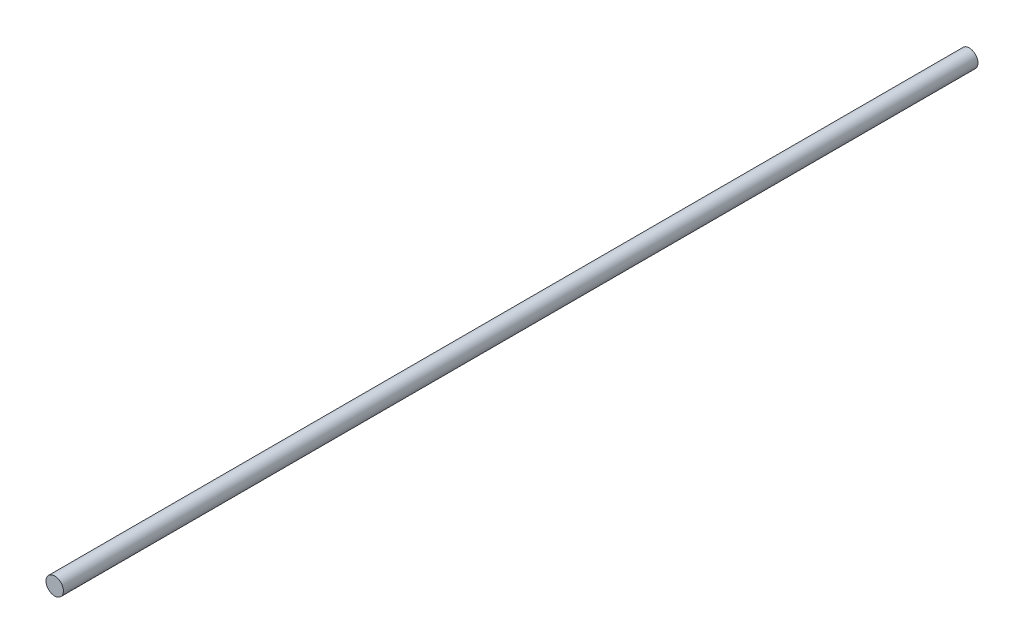
ISO-10303-21;
HEADER;
FILE_DESCRIPTION(('STEP AP214'),'2;1');
FILE_NAME('part.step','',(''),(''),'','','');
FILE_SCHEMA(('AUTOMOTIVE_DESIGN { 1 0 10303 214 1 1 1 1 }'));
ENDSEC;
DATA;
#1=APPLICATION_CONTEXT('core data for automotive mechanical design processes');
#2=APPLICATION_PROTOCOL_DEFINITION('international standard','automotive_design',2000,#1);
#3=PRODUCT_CONTEXT('',#1,'mechanical');
#4=PRODUCT('Part','Part','',(#3));
#5=PRODUCT_RELATED_PRODUCT_CATEGORY('part','',(#4));
#6=PRODUCT_DEFINITION_FORMATION('','',#4);
#7=PRODUCT_DEFINITION_CONTEXT('part definition',#1,'design');
#8=PRODUCT_DEFINITION('design','',#6,#7);
#9=PRODUCT_DEFINITION_SHAPE('','',#8);
#10=(LENGTH_UNIT() NAMED_UNIT(*) SI_UNIT(.MILLI.,.METRE.));
#11=(NAMED_UNIT(*) PLANE_ANGLE_UNIT() SI_UNIT($,.RADIAN.));
#12=(NAMED_UNIT(*) SI_UNIT($,.STERADIAN.) SOLID_ANGLE_UNIT());
#13=UNCERTAINTY_MEASURE_WITH_UNIT(LENGTH_MEASURE(1.E-05),#10,'distance_accuracy_value','');
#14=(GEOMETRIC_REPRESENTATION_CONTEXT(3) GLOBAL_UNCERTAINTY_ASSIGNED_CONTEXT((#13)) GLOBAL_UNIT_ASSIGNED_CONTEXT((#10,
#11,#12)) REPRESENTATION_CONTEXT('',''));
#15=CARTESIAN_POINT('',(0.,0.,0.));
#16=DIRECTION('',(0.,0.,1.));
#17=DIRECTION('',(1.,0.,0.));
#18=AXIS2_PLACEMENT_3D('',#15,#16,#17);
#19=CARTESIAN_POINT('',(-48.8752986194464,81.4071564152755,420.));
#20=DIRECTION('',(0.,0.,-1.));
#21=DIRECTION('',(-1.,0.,0.));
#22=AXIS2_PLACEMENT_3D('',#19,#20,#21);
#23=CYLINDRICAL_SURFACE('',#22,4.);
#24=CARTESIAN_POINT('',(-48.8752986194464,81.4071564152755,420.));
#25=DIRECTION('',(0.,0.,1.));
#26=DIRECTION('',(1.,0.,0.));
#27=AXIS2_PLACEMENT_3D('',#24,#25,#26);
#28=CIRCLE('',#27,4.);
#29=CARTESIAN_POINT('',(-44.8752986194464,81.4071564152755,420.));
#30=VERTEX_POINT('',#29);
#31=EDGE_CURVE('E12',#30,#30,#28,.T.);
#32=ORIENTED_EDGE('',*,*,#31,.F.);
#33=EDGE_LOOP('',(#32));
#34=FACE_BOUND('',#33,.T.);
#35=CARTESIAN_POINT('',(-48.8752986194464,81.4071564152755,0.));
#36=DIRECTION('',(0.,0.,1.));
#37=DIRECTION('',(1.,0.,0.));
#38=AXIS2_PLACEMENT_3D('',#35,#36,#37);
#39=CIRCLE('',#38,4.);
#40=CARTESIAN_POINT('',(-44.8752986194464,81.4071564152755,0.));
#41=VERTEX_POINT('',#40);
#42=EDGE_CURVE('E44',#41,#41,#39,.T.);
#43=ORIENTED_EDGE('',*,*,#42,.T.);
#44=EDGE_LOOP('',(#43));
#45=FACE_BOUND('',#44,.T.);
#46=ADVANCED_FACE('F41',(#34,#45),#23,.T.);
#47=CARTESIAN_POINT('',(-48.8752986194464,81.4071564152755,420.));
#48=DIRECTION('',(0.,0.,1.));
#49=DIRECTION('',(1.,0.,0.));
#50=AXIS2_PLACEMENT_3D('',#47,#48,#49);
#51=PLANE('',#50);
#52=ORIENTED_EDGE('',*,*,#31,.T.);
#53=EDGE_LOOP('',(#52));
#54=FACE_BOUND('',#53,.T.);
#55=ADVANCED_FACE('F56',(#54),#51,.T.);
#56=CARTESIAN_POINT('',(-48.8752986194464,81.4071564152755,0.));
#57=DIRECTION('',(0.,0.,1.));
#58=DIRECTION('',(1.,0.,0.));
#59=AXIS2_PLACEMENT_3D('',#56,#57,#58);
#60=PLANE('',#59);
#61=ORIENTED_EDGE('',*,*,#42,.F.);
#62=EDGE_LOOP('',(#61));
#63=FACE_BOUND('',#62,.T.);
#64=ADVANCED_FACE('F54',(#63),#60,.F.);
#65=CLOSED_SHELL('',(#46,#55,#64));
#66=MANIFOLD_SOLID_BREP('B2',#65);
#67=ADVANCED_BREP_SHAPE_REPRESENTATION('',(#18,#66),#14);
#68=SHAPE_DEFINITION_REPRESENTATION(#9,#67);
ENDSEC;
END-ISO-10303-21;
